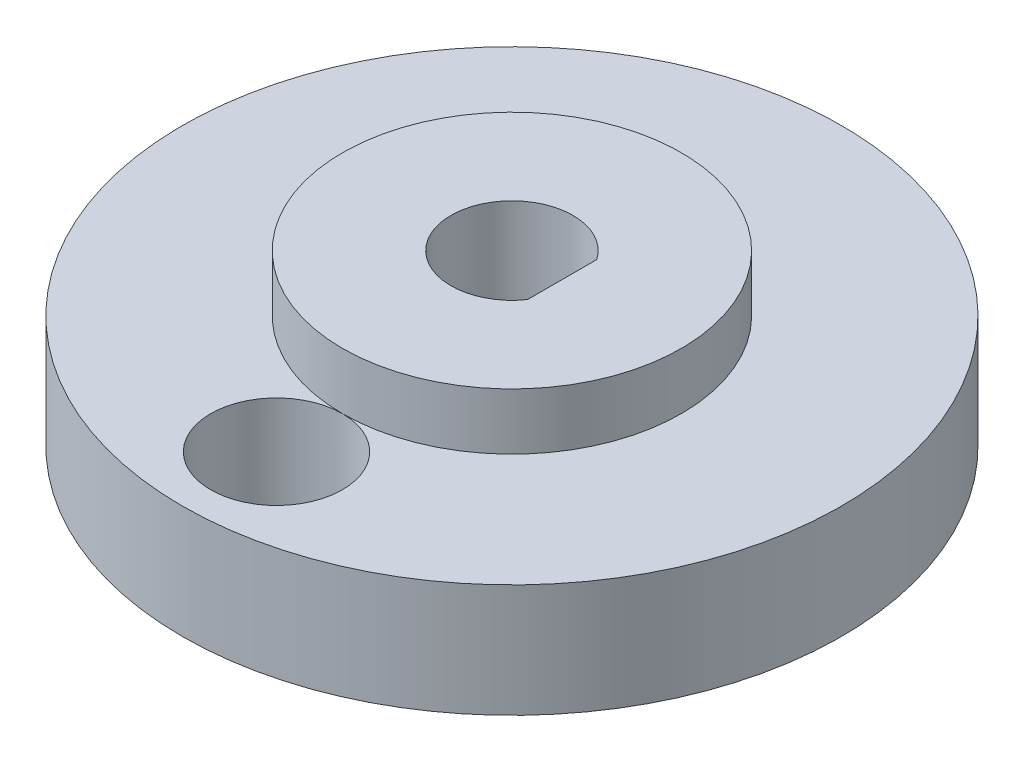
ISO-10303-21;
HEADER;
FILE_DESCRIPTION(('STEP AP214'),'2;1');
FILE_NAME('part.step','',(''),(''),'','','');
FILE_SCHEMA(('AUTOMOTIVE_DESIGN { 1 0 10303 214 1 1 1 1 }'));
ENDSEC;
DATA;
#1=APPLICATION_CONTEXT('core data for automotive mechanical design processes');
#2=APPLICATION_PROTOCOL_DEFINITION('international standard','automotive_design',2000,#1);
#3=PRODUCT_CONTEXT('',#1,'mechanical');
#4=PRODUCT('Part','Part','',(#3));
#5=PRODUCT_RELATED_PRODUCT_CATEGORY('part','',(#4));
#6=PRODUCT_DEFINITION_FORMATION('','',#4);
#7=PRODUCT_DEFINITION_CONTEXT('part definition',#1,'design');
#8=PRODUCT_DEFINITION('design','',#6,#7);
#9=PRODUCT_DEFINITION_SHAPE('','',#8);
#10=(LENGTH_UNIT() NAMED_UNIT(*) SI_UNIT(.MILLI.,.METRE.));
#11=(NAMED_UNIT(*) PLANE_ANGLE_UNIT() SI_UNIT($,.RADIAN.));
#12=(NAMED_UNIT(*) SI_UNIT($,.STERADIAN.) SOLID_ANGLE_UNIT());
#13=UNCERTAINTY_MEASURE_WITH_UNIT(LENGTH_MEASURE(1.E-05),#10,'distance_accuracy_value','');
#14=(GEOMETRIC_REPRESENTATION_CONTEXT(3) GLOBAL_UNCERTAINTY_ASSIGNED_CONTEXT((#13)) GLOBAL_UNIT_ASSIGNED_CONTEXT((#10,
#11,#12)) REPRESENTATION_CONTEXT('',''));
#15=CARTESIAN_POINT('',(0.,0.,0.));
#16=DIRECTION('',(0.,0.,1.));
#17=DIRECTION('',(1.,0.,0.));
#18=AXIS2_PLACEMENT_3D('',#15,#16,#17);
#19=CARTESIAN_POINT('',(0.,6.,0.));
#20=DIRECTION('',(0.,-1.,0.));
#21=DIRECTION('',(0.,0.,-1.));
#22=AXIS2_PLACEMENT_3D('',#19,#20,#21);
#23=CYLINDRICAL_SURFACE('',#22,17.5);
#24=CARTESIAN_POINT('',(0.,6.,0.));
#25=DIRECTION('',(0.,1.,0.));
#26=DIRECTION('',(0.,0.,1.));
#27=AXIS2_PLACEMENT_3D('',#24,#25,#26);
#28=CIRCLE('',#27,17.5);
#29=CARTESIAN_POINT('',(0.,6.,17.5));
#30=VERTEX_POINT('',#29);
#31=EDGE_CURVE('E47',#30,#30,#28,.T.);
#32=ORIENTED_EDGE('',*,*,#31,.F.);
#33=EDGE_LOOP('',(#32));
#34=FACE_BOUND('',#33,.T.);
#35=CARTESIAN_POINT('',(0.,0.,0.));
#36=DIRECTION('',(0.,1.,0.));
#37=DIRECTION('',(0.,0.,1.));
#38=AXIS2_PLACEMENT_3D('',#35,#36,#37);
#39=CIRCLE('',#38,17.5);
#40=CARTESIAN_POINT('',(0.,0.,17.5));
#41=VERTEX_POINT('',#40);
#42=EDGE_CURVE('E41',#41,#41,#39,.T.);
#43=ORIENTED_EDGE('',*,*,#42,.T.);
#44=EDGE_LOOP('',(#43));
#45=FACE_BOUND('',#44,.T.);
#46=ADVANCED_FACE('F38',(#34,#45),#23,.T.);
#47=CARTESIAN_POINT('',(0.,6.,0.));
#48=DIRECTION('',(0.,1.,0.));
#49=DIRECTION('',(0.,0.,1.));
#50=AXIS2_PLACEMENT_3D('',#47,#48,#49);
#51=PLANE('',#50);
#52=CARTESIAN_POINT('',(0.,6.,0.));
#53=DIRECTION('',(0.,1.,0.));
#54=DIRECTION('',(0.,0.,1.));
#55=AXIS2_PLACEMENT_3D('',#52,#53,#54);
#56=CIRCLE('',#55,9.);
#57=CARTESIAN_POINT('',(0.,6.,9.));
#58=VERTEX_POINT('',#57);
#59=EDGE_CURVE('E11',#58,#58,#56,.T.);
#60=ORIENTED_EDGE('',*,*,#59,.F.);
#61=CARTESIAN_POINT('',(0.,6.,12.5));
#62=DIRECTION('',(0.,1.,0.));
#63=DIRECTION('',(0.,0.,1.));
#64=AXIS2_PLACEMENT_3D('',#61,#62,#63);
#65=CIRCLE('',#64,3.5);
#66=EDGE_CURVE('E53',#58,#58,#65,.F.);
#67=ORIENTED_EDGE('',*,*,#66,.T.);
#68=EDGE_LOOP('',(#60,#67));
#69=FACE_BOUND('',#68,.T.);
#70=ORIENTED_EDGE('',*,*,#31,.T.);
#71=EDGE_LOOP('',(#70));
#72=FACE_BOUND('',#71,.T.);
#73=ADVANCED_FACE('F113',(#69,#72),#51,.T.);
#74=CARTESIAN_POINT('',(0.,0.,0.));
#75=DIRECTION('',(0.,1.,0.));
#76=DIRECTION('',(0.,0.,1.));
#77=AXIS2_PLACEMENT_3D('',#74,#75,#76);
#78=PLANE('',#77);
#79=CARTESIAN_POINT('',(0.,0.,12.5));
#80=DIRECTION('',(0.,1.,0.));
#81=DIRECTION('',(0.,0.,1.));
#82=AXIS2_PLACEMENT_3D('',#79,#80,#81);
#83=CIRCLE('',#82,3.5);
#84=CARTESIAN_POINT('',(0.,0.,16.));
#85=VERTEX_POINT('',#84);
#86=EDGE_CURVE('E183',#85,#85,#83,.T.);
#87=ORIENTED_EDGE('',*,*,#86,.T.);
#88=EDGE_LOOP('',(#87));
#89=FACE_BOUND('',#88,.T.);
#90=DIRECTION('',(0.,0.,1.));
#91=VECTOR('',#90,1.);
#92=CARTESIAN_POINT('',(2.667,0.,0.));
#93=LINE('',#92,#91);
#94=CARTESIAN_POINT('',(2.667,0.,-1.83711546996916));
#95=VERTEX_POINT('',#94);
#96=CARTESIAN_POINT('',(2.667,0.,1.83711546996916));
#97=VERTEX_POINT('',#96);
#98=EDGE_CURVE('E72',#95,#97,#93,.T.);
#99=ORIENTED_EDGE('',*,*,#98,.F.);
#100=CARTESIAN_POINT('',(0.,0.,0.));
#101=DIRECTION('',(0.,1.,0.));
#102=DIRECTION('',(0.,0.,1.));
#103=AXIS2_PLACEMENT_3D('',#100,#101,#102);
#104=CIRCLE('',#103,3.2385);
#105=EDGE_CURVE('E60',#95,#97,#104,.T.);
#106=ORIENTED_EDGE('',*,*,#105,.T.);
#107=EDGE_LOOP('',(#99,#106));
#108=FACE_BOUND('',#107,.T.);
#109=ORIENTED_EDGE('',*,*,#42,.F.);
#110=EDGE_LOOP('',(#109));
#111=FACE_BOUND('',#110,.T.);
#112=ADVANCED_FACE('F86',(#89,#108,#111),#78,.F.);
#113=CARTESIAN_POINT('',(0.,9.,0.));
#114=DIRECTION('',(0.,-1.,0.));
#115=DIRECTION('',(0.,0.,-1.));
#116=AXIS2_PLACEMENT_3D('',#113,#114,#115);
#117=CYLINDRICAL_SURFACE('',#116,9.);
#118=ORIENTED_EDGE('',*,*,#59,.T.);
#119=EDGE_LOOP('',(#118));
#120=FACE_BOUND('',#119,.T.);
#121=CARTESIAN_POINT('',(0.,9.,0.));
#122=DIRECTION('',(0.,1.,0.));
#123=DIRECTION('',(0.,0.,1.));
#124=AXIS2_PLACEMENT_3D('',#121,#122,#123);
#125=CIRCLE('',#124,9.);
#126=CARTESIAN_POINT('',(0.,9.,9.));
#127=VERTEX_POINT('',#126);
#128=EDGE_CURVE('E99',#127,#127,#125,.T.);
#129=ORIENTED_EDGE('',*,*,#128,.F.);
#130=EDGE_LOOP('',(#129));
#131=FACE_BOUND('',#130,.T.);
#132=ADVANCED_FACE('F112',(#120,#131),#117,.T.);
#133=CARTESIAN_POINT('',(0.,9.,0.));
#134=DIRECTION('',(0.,1.,0.));
#135=DIRECTION('',(0.,0.,1.));
#136=AXIS2_PLACEMENT_3D('',#133,#134,#135);
#137=PLANE('',#136);
#138=CARTESIAN_POINT('',(0.,9.,0.));
#139=DIRECTION('',(0.,1.,0.));
#140=DIRECTION('',(0.,0.,1.));
#141=AXIS2_PLACEMENT_3D('',#138,#139,#140);
#142=CIRCLE('',#141,3.2385);
#143=CARTESIAN_POINT('',(2.667,9.,-1.83711546996916));
#144=VERTEX_POINT('',#143);
#145=CARTESIAN_POINT('',(2.667,9.,1.83711546996916));
#146=VERTEX_POINT('',#145);
#147=EDGE_CURVE('E83',#144,#146,#142,.T.);
#148=ORIENTED_EDGE('',*,*,#147,.F.);
#149=DIRECTION('',(0.,0.,1.));
#150=VECTOR('',#149,1.);
#151=CARTESIAN_POINT('',(2.667,9.,0.));
#152=LINE('',#151,#150);
#153=EDGE_CURVE('E89',#144,#146,#152,.T.);
#154=ORIENTED_EDGE('',*,*,#153,.T.);
#155=EDGE_LOOP('',(#148,#154));
#156=FACE_BOUND('',#155,.T.);
#157=ORIENTED_EDGE('',*,*,#128,.T.);
#158=EDGE_LOOP('',(#157));
#159=FACE_BOUND('',#158,.T.);
#160=ADVANCED_FACE('F119',(#156,#159),#137,.T.);
#161=CARTESIAN_POINT('',(0.,0.,0.));
#162=DIRECTION('',(0.,1.,0.));
#163=DIRECTION('',(0.,0.,1.));
#164=AXIS2_PLACEMENT_3D('',#161,#162,#163);
#165=CYLINDRICAL_SURFACE('',#164,3.2385);
#166=ORIENTED_EDGE('',*,*,#147,.T.);
#167=DIRECTION('',(0.,1.,0.));
#168=VECTOR('',#167,1.);
#169=CARTESIAN_POINT('',(2.667,0.,1.83711546996916));
#170=LINE('',#169,#168);
#171=EDGE_CURVE('E75',#97,#146,#170,.T.);
#172=ORIENTED_EDGE('',*,*,#171,.F.);
#173=ORIENTED_EDGE('',*,*,#105,.F.);
#174=DIRECTION('',(0.,1.,0.));
#175=VECTOR('',#174,1.);
#176=CARTESIAN_POINT('',(2.667,0.,-1.83711546996916));
#177=LINE('',#176,#175);
#178=EDGE_CURVE('E77',#95,#144,#177,.T.);
#179=ORIENTED_EDGE('',*,*,#178,.T.);
#180=EDGE_LOOP('',(#166,#172,#173,#179));
#181=FACE_BOUND('',#180,.T.);
#182=ADVANCED_FACE('F81',(#181),#165,.F.);
#183=CARTESIAN_POINT('',(2.667,0.,0.));
#184=DIRECTION('',(-1.,0.,0.));
#185=DIRECTION('',(0.,0.,1.));
#186=AXIS2_PLACEMENT_3D('',#183,#184,#185);
#187=PLANE('',#186);
#188=ORIENTED_EDGE('',*,*,#153,.F.);
#189=ORIENTED_EDGE('',*,*,#178,.F.);
#190=ORIENTED_EDGE('',*,*,#98,.T.);
#191=ORIENTED_EDGE('',*,*,#171,.T.);
#192=EDGE_LOOP('',(#188,#189,#190,#191));
#193=FACE_BOUND('',#192,.T.);
#194=ADVANCED_FACE('F74',(#193),#187,.T.);
#195=CARTESIAN_POINT('',(0.,9.,12.5));
#196=DIRECTION('',(0.,-1.,0.));
#197=DIRECTION('',(0.,0.,-1.));
#198=AXIS2_PLACEMENT_3D('',#195,#196,#197);
#199=CYLINDRICAL_SURFACE('',#198,3.5);
#200=ORIENTED_EDGE('',*,*,#66,.F.);
#201=EDGE_LOOP('',(#200));
#202=FACE_BOUND('',#201,.T.);
#203=ORIENTED_EDGE('',*,*,#86,.F.);
#204=EDGE_LOOP('',(#203));
#205=FACE_BOUND('',#204,.T.);
#206=ADVANCED_FACE('F164',(#202,#205),#199,.F.);
#207=CLOSED_SHELL('',(#46,#73,#112,#132,#160,#182,#194,#206));
#208=MANIFOLD_SOLID_BREP('B2',#207);
#209=ADVANCED_BREP_SHAPE_REPRESENTATION('',(#18,#208),#14);
#210=SHAPE_DEFINITION_REPRESENTATION(#9,#209);
ENDSEC;
END-ISO-10303-21;
